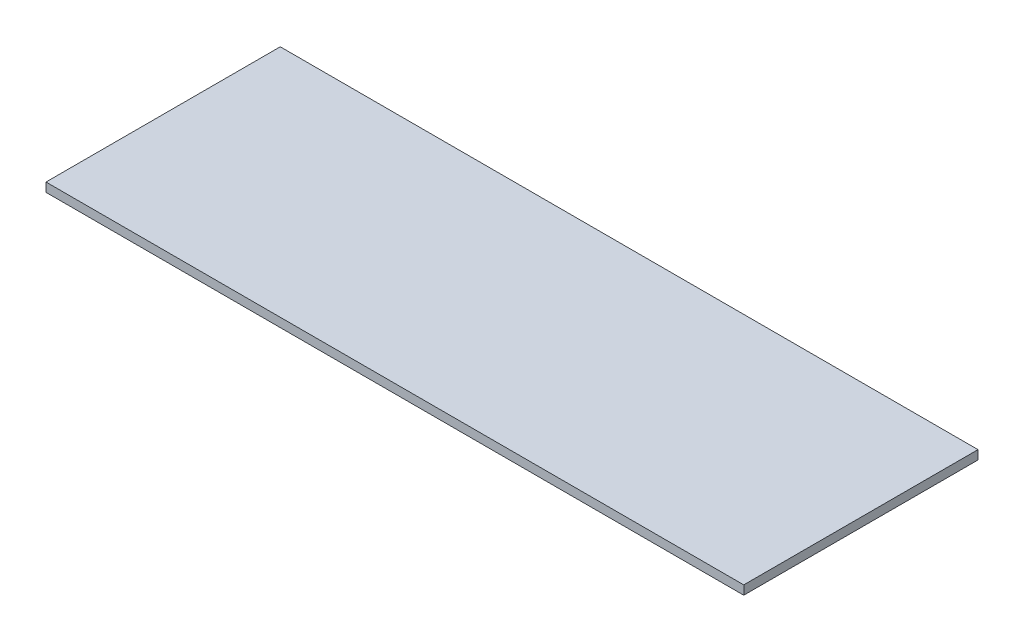
ISO-10303-21;
HEADER;
FILE_DESCRIPTION(('STEP AP214'),'2;1');
FILE_NAME('part.step','',(''),(''),'','','');
FILE_SCHEMA(('AUTOMOTIVE_DESIGN { 1 0 10303 214 1 1 1 1 }'));
ENDSEC;
DATA;
#1=APPLICATION_CONTEXT('core data for automotive mechanical design processes');
#2=APPLICATION_PROTOCOL_DEFINITION('international standard','automotive_design',2000,#1);
#3=PRODUCT_CONTEXT('',#1,'mechanical');
#4=PRODUCT('Part','Part','',(#3));
#5=PRODUCT_RELATED_PRODUCT_CATEGORY('part','',(#4));
#6=PRODUCT_DEFINITION_FORMATION('','',#4);
#7=PRODUCT_DEFINITION_CONTEXT('part definition',#1,'design');
#8=PRODUCT_DEFINITION('design','',#6,#7);
#9=PRODUCT_DEFINITION_SHAPE('','',#8);
#10=(LENGTH_UNIT() NAMED_UNIT(*) SI_UNIT(.MILLI.,.METRE.));
#11=(NAMED_UNIT(*) PLANE_ANGLE_UNIT() SI_UNIT($,.RADIAN.));
#12=(NAMED_UNIT(*) SI_UNIT($,.STERADIAN.) SOLID_ANGLE_UNIT());
#13=UNCERTAINTY_MEASURE_WITH_UNIT(LENGTH_MEASURE(1.E-05),#10,'distance_accuracy_value','');
#14=(GEOMETRIC_REPRESENTATION_CONTEXT(3) GLOBAL_UNCERTAINTY_ASSIGNED_CONTEXT((#13)) GLOBAL_UNIT_ASSIGNED_CONTEXT((#10,
#11,#12)) REPRESENTATION_CONTEXT('',''));
#15=CARTESIAN_POINT('',(0.,0.,0.));
#16=DIRECTION('',(0.,0.,1.));
#17=DIRECTION('',(1.,0.,0.));
#18=AXIS2_PLACEMENT_3D('',#15,#16,#17);
#19=CARTESIAN_POINT('',(0.,18.,0.));
#20=DIRECTION('',(1.,0.,0.));
#21=DIRECTION('',(0.,0.,-1.));
#22=AXIS2_PLACEMENT_3D('',#19,#20,#21);
#23=PLANE('',#22);
#24=DIRECTION('',(0.,0.,1.));
#25=VECTOR('',#24,1.);
#26=CARTESIAN_POINT('',(0.,0.,0.));
#27=LINE('',#26,#25);
#28=CARTESIAN_POINT('',(0.,0.,-470.));
#29=VERTEX_POINT('',#28);
#30=CARTESIAN_POINT('',(0.,0.,0.));
#31=VERTEX_POINT('',#30);
#32=EDGE_CURVE('E96',#29,#31,#27,.T.);
#33=ORIENTED_EDGE('',*,*,#32,.T.);
#34=DIRECTION('',(0.,-1.,0.));
#35=VECTOR('',#34,1.);
#36=CARTESIAN_POINT('',(0.,18.,0.));
#37=LINE('',#36,#35);
#38=CARTESIAN_POINT('',(0.,18.,0.));
#39=VERTEX_POINT('',#38);
#40=EDGE_CURVE('E11',#39,#31,#37,.T.);
#41=ORIENTED_EDGE('',*,*,#40,.F.);
#42=DIRECTION('',(0.,0.,1.));
#43=VECTOR('',#42,1.);
#44=CARTESIAN_POINT('',(0.,18.,0.));
#45=LINE('',#44,#43);
#46=CARTESIAN_POINT('',(0.,18.,-470.));
#47=VERTEX_POINT('',#46);
#48=EDGE_CURVE('E84',#47,#39,#45,.T.);
#49=ORIENTED_EDGE('',*,*,#48,.F.);
#50=DIRECTION('',(0.,-1.,0.));
#51=VECTOR('',#50,1.);
#52=CARTESIAN_POINT('',(0.,18.,-470.));
#53=LINE('',#52,#51);
#54=EDGE_CURVE('E92',#47,#29,#53,.T.);
#55=ORIENTED_EDGE('',*,*,#54,.T.);
#56=EDGE_LOOP('',(#33,#41,#49,#55));
#57=FACE_BOUND('',#56,.T.);
#58=ADVANCED_FACE('F33',(#57),#23,.F.);
#59=CARTESIAN_POINT('',(0.,18.,0.));
#60=DIRECTION('',(0.,0.,-1.));
#61=DIRECTION('',(-1.,0.,0.));
#62=AXIS2_PLACEMENT_3D('',#59,#60,#61);
#63=PLANE('',#62);
#64=DIRECTION('',(1.,0.,0.));
#65=VECTOR('',#64,1.);
#66=CARTESIAN_POINT('',(0.,0.,0.));
#67=LINE('',#66,#65);
#68=CARTESIAN_POINT('',(1400.,0.,0.));
#69=VERTEX_POINT('',#68);
#70=EDGE_CURVE('E88',#31,#69,#67,.T.);
#71=ORIENTED_EDGE('',*,*,#70,.T.);
#72=DIRECTION('',(0.,-1.,0.));
#73=VECTOR('',#72,1.);
#74=CARTESIAN_POINT('',(1400.,18.,0.));
#75=LINE('',#74,#73);
#76=CARTESIAN_POINT('',(1400.,18.,0.));
#77=VERTEX_POINT('',#76);
#78=EDGE_CURVE('E41',#77,#69,#75,.T.);
#79=ORIENTED_EDGE('',*,*,#78,.F.);
#80=DIRECTION('',(1.,0.,0.));
#81=VECTOR('',#80,1.);
#82=CARTESIAN_POINT('',(0.,18.,0.));
#83=LINE('',#82,#81);
#84=EDGE_CURVE('E79',#39,#77,#83,.T.);
#85=ORIENTED_EDGE('',*,*,#84,.F.);
#86=ORIENTED_EDGE('',*,*,#40,.T.);
#87=EDGE_LOOP('',(#71,#79,#85,#86));
#88=FACE_BOUND('',#87,.T.);
#89=ADVANCED_FACE('F87',(#88),#63,.F.);
#90=CARTESIAN_POINT('',(1400.,18.,0.));
#91=DIRECTION('',(-1.,0.,0.));
#92=DIRECTION('',(0.,0.,1.));
#93=AXIS2_PLACEMENT_3D('',#90,#91,#92);
#94=PLANE('',#93);
#95=DIRECTION('',(0.,0.,-1.));
#96=VECTOR('',#95,1.);
#97=CARTESIAN_POINT('',(1400.,0.,0.));
#98=LINE('',#97,#96);
#99=CARTESIAN_POINT('',(1400.,0.,-470.));
#100=VERTEX_POINT('',#99);
#101=EDGE_CURVE('E66',#69,#100,#98,.T.);
#102=ORIENTED_EDGE('',*,*,#101,.T.);
#103=DIRECTION('',(0.,-1.,0.));
#104=VECTOR('',#103,1.);
#105=CARTESIAN_POINT('',(1400.,18.,-470.));
#106=LINE('',#105,#104);
#107=CARTESIAN_POINT('',(1400.,18.,-470.));
#108=VERTEX_POINT('',#107);
#109=EDGE_CURVE('E89',#108,#100,#106,.T.);
#110=ORIENTED_EDGE('',*,*,#109,.F.);
#111=DIRECTION('',(0.,0.,-1.));
#112=VECTOR('',#111,1.);
#113=CARTESIAN_POINT('',(1400.,18.,0.));
#114=LINE('',#113,#112);
#115=EDGE_CURVE('E82',#77,#108,#114,.T.);
#116=ORIENTED_EDGE('',*,*,#115,.F.);
#117=ORIENTED_EDGE('',*,*,#78,.T.);
#118=EDGE_LOOP('',(#102,#110,#116,#117));
#119=FACE_BOUND('',#118,.T.);
#120=ADVANCED_FACE('F90',(#119),#94,.F.);
#121=CARTESIAN_POINT('',(0.,18.,-470.));
#122=DIRECTION('',(0.,0.,1.));
#123=DIRECTION('',(1.,0.,0.));
#124=AXIS2_PLACEMENT_3D('',#121,#122,#123);
#125=PLANE('',#124);
#126=DIRECTION('',(-1.,0.,0.));
#127=VECTOR('',#126,1.);
#128=CARTESIAN_POINT('',(0.,0.,-470.));
#129=LINE('',#128,#127);
#130=EDGE_CURVE('E72',#100,#29,#129,.T.);
#131=ORIENTED_EDGE('',*,*,#130,.T.);
#132=ORIENTED_EDGE('',*,*,#54,.F.);
#133=DIRECTION('',(-1.,0.,0.));
#134=VECTOR('',#133,1.);
#135=CARTESIAN_POINT('',(0.,18.,-470.));
#136=LINE('',#135,#134);
#137=EDGE_CURVE('E49',#108,#47,#136,.T.);
#138=ORIENTED_EDGE('',*,*,#137,.F.);
#139=ORIENTED_EDGE('',*,*,#109,.T.);
#140=EDGE_LOOP('',(#131,#132,#138,#139));
#141=FACE_BOUND('',#140,.T.);
#142=ADVANCED_FACE('F103',(#141),#125,.F.);
#143=CARTESIAN_POINT('',(0.,18.,0.));
#144=DIRECTION('',(0.,-1.,0.));
#145=DIRECTION('',(0.,0.,-1.));
#146=AXIS2_PLACEMENT_3D('',#143,#144,#145);
#147=PLANE('',#146);
#148=ORIENTED_EDGE('',*,*,#48,.T.);
#149=ORIENTED_EDGE('',*,*,#84,.T.);
#150=ORIENTED_EDGE('',*,*,#115,.T.);
#151=ORIENTED_EDGE('',*,*,#137,.T.);
#152=EDGE_LOOP('',(#148,#149,#150,#151));
#153=FACE_BOUND('',#152,.T.);
#154=ADVANCED_FACE('F80',(#153),#147,.F.);
#155=CARTESIAN_POINT('',(0.,0.,0.));
#156=DIRECTION('',(0.,-1.,0.));
#157=DIRECTION('',(0.,0.,-1.));
#158=AXIS2_PLACEMENT_3D('',#155,#156,#157);
#159=PLANE('',#158);
#160=ORIENTED_EDGE('',*,*,#32,.F.);
#161=ORIENTED_EDGE('',*,*,#130,.F.);
#162=ORIENTED_EDGE('',*,*,#101,.F.);
#163=ORIENTED_EDGE('',*,*,#70,.F.);
#164=EDGE_LOOP('',(#160,#161,#162,#163));
#165=FACE_BOUND('',#164,.T.);
#166=ADVANCED_FACE('F106',(#165),#159,.T.);
#167=CLOSED_SHELL('',(#58,#89,#120,#142,#154,#166));
#168=MANIFOLD_SOLID_BREP('B2',#167);
#169=ADVANCED_BREP_SHAPE_REPRESENTATION('',(#18,#168),#14);
#170=SHAPE_DEFINITION_REPRESENTATION(#9,#169);
ENDSEC;
END-ISO-10303-21;
